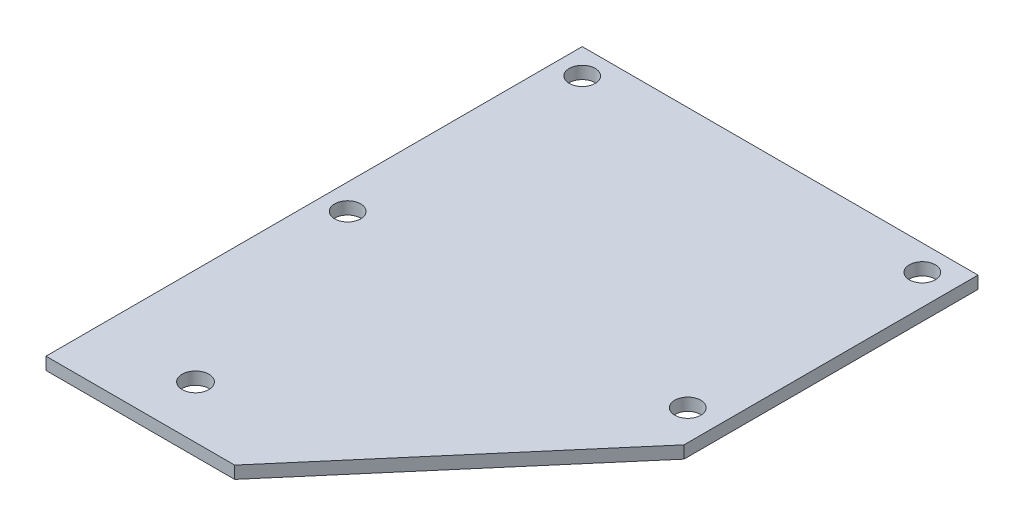
ISO-10303-21;
HEADER;
FILE_DESCRIPTION(('STEP AP214'),'2;1');
FILE_NAME('part.step','',(''),(''),'','','');
FILE_SCHEMA(('AUTOMOTIVE_DESIGN { 1 0 10303 214 1 1 1 1 }'));
ENDSEC;
DATA;
#1=APPLICATION_CONTEXT('core data for automotive mechanical design processes');
#2=APPLICATION_PROTOCOL_DEFINITION('international standard','automotive_design',2000,#1);
#3=PRODUCT_CONTEXT('',#1,'mechanical');
#4=PRODUCT('Part','Part','',(#3));
#5=PRODUCT_RELATED_PRODUCT_CATEGORY('part','',(#4));
#6=PRODUCT_DEFINITION_FORMATION('','',#4);
#7=PRODUCT_DEFINITION_CONTEXT('part definition',#1,'design');
#8=PRODUCT_DEFINITION('design','',#6,#7);
#9=PRODUCT_DEFINITION_SHAPE('','',#8);
#10=(LENGTH_UNIT() NAMED_UNIT(*) SI_UNIT(.MILLI.,.METRE.));
#11=(NAMED_UNIT(*) PLANE_ANGLE_UNIT() SI_UNIT($,.RADIAN.));
#12=(NAMED_UNIT(*) SI_UNIT($,.STERADIAN.) SOLID_ANGLE_UNIT());
#13=UNCERTAINTY_MEASURE_WITH_UNIT(LENGTH_MEASURE(1.E-05),#10,'distance_accuracy_value','');
#14=(GEOMETRIC_REPRESENTATION_CONTEXT(3) GLOBAL_UNCERTAINTY_ASSIGNED_CONTEXT((#13)) GLOBAL_UNIT_ASSIGNED_CONTEXT((#10,
#11,#12)) REPRESENTATION_CONTEXT('',''));
#15=CARTESIAN_POINT('',(0.,0.,0.));
#16=DIRECTION('',(0.,0.,1.));
#17=DIRECTION('',(1.,0.,0.));
#18=AXIS2_PLACEMENT_3D('',#15,#16,#17);
#19=CARTESIAN_POINT('',(0.,3.175,0.));
#20=DIRECTION('',(0.,-1.,0.));
#21=DIRECTION('',(0.,0.,-1.));
#22=AXIS2_PLACEMENT_3D('',#19,#20,#21);
#23=PLANE('',#22);
#24=DIRECTION('',(0.,0.,-1.));
#25=VECTOR('',#24,1.);
#26=CARTESIAN_POINT('',(101.24,3.175,-68.58));
#27=LINE('',#26,#25);
#28=CARTESIAN_POINT('',(101.24,3.175,6.62));
#29=VERTEX_POINT('',#28);
#30=CARTESIAN_POINT('',(101.24,3.175,-68.58));
#31=VERTEX_POINT('',#30);
#32=EDGE_CURVE('E116',#29,#31,#27,.T.);
#33=ORIENTED_EDGE('',*,*,#32,.T.);
#34=DIRECTION('',(-1.,0.,0.));
#35=VECTOR('',#34,1.);
#36=CARTESIAN_POINT('',(0.,3.175,-68.58));
#37=LINE('',#36,#35);
#38=CARTESIAN_POINT('',(0.,3.175,-68.58));
#39=VERTEX_POINT('',#38);
#40=EDGE_CURVE('E83',#31,#39,#37,.T.);
#41=ORIENTED_EDGE('',*,*,#40,.T.);
#42=DIRECTION('',(0.,0.,1.));
#43=VECTOR('',#42,1.);
#44=CARTESIAN_POINT('',(0.,3.175,68.58));
#45=LINE('',#44,#43);
#46=CARTESIAN_POINT('',(0.,3.175,68.58));
#47=VERTEX_POINT('',#46);
#48=EDGE_CURVE('E87',#39,#47,#45,.T.);
#49=ORIENTED_EDGE('',*,*,#48,.T.);
#50=DIRECTION('',(1.,0.,0.));
#51=VECTOR('',#50,1.);
#52=CARTESIAN_POINT('',(48.26,3.175,68.58));
#53=LINE('',#52,#51);
#54=CARTESIAN_POINT('',(48.26,3.175,68.58));
#55=VERTEX_POINT('',#54);
#56=EDGE_CURVE('E91',#47,#55,#53,.T.);
#57=ORIENTED_EDGE('',*,*,#56,.T.);
#58=DIRECTION('',(0.649881739167687,0.,-0.760035344636276));
#59=VECTOR('',#58,1.);
#60=CARTESIAN_POINT('',(101.24,3.175,6.62));
#61=LINE('',#60,#59);
#62=EDGE_CURVE('E49',#55,#29,#61,.T.);
#63=ORIENTED_EDGE('',*,*,#62,.T.);
#64=EDGE_LOOP('',(#33,#41,#49,#57,#63));
#65=FACE_BOUND('',#64,.T.);
#66=CARTESIAN_POINT('',(93.5,3.175,-62.08));
#67=DIRECTION('',(0.,1.,0.));
#68=DIRECTION('',(0.,0.,1.));
#69=AXIS2_PLACEMENT_3D('',#66,#67,#68);
#70=CIRCLE('',#69,3.32999999999999);
#71=CARTESIAN_POINT('',(93.5,3.175,-58.75));
#72=VERTEX_POINT('',#71);
#73=EDGE_CURVE('E111',#72,#72,#70,.T.);
#74=ORIENTED_EDGE('',*,*,#73,.F.);
#75=EDGE_LOOP('',(#74));
#76=FACE_BOUND('',#75,.T.);
#77=CARTESIAN_POINT('',(6.5,3.175,-62.08));
#78=DIRECTION('',(0.,1.,0.));
#79=DIRECTION('',(0.,0.,1.));
#80=AXIS2_PLACEMENT_3D('',#77,#78,#79);
#81=CIRCLE('',#80,3.33000000000001);
#82=CARTESIAN_POINT('',(6.5,3.175,-58.75));
#83=VERTEX_POINT('',#82);
#84=EDGE_CURVE('E185',#83,#83,#81,.T.);
#85=ORIENTED_EDGE('',*,*,#84,.F.);
#86=EDGE_LOOP('',(#85));
#87=FACE_BOUND('',#86,.T.);
#88=CARTESIAN_POINT('',(93.5,3.175,-2.08000000000001));
#89=DIRECTION('',(0.,1.,0.));
#90=DIRECTION('',(0.,0.,1.));
#91=AXIS2_PLACEMENT_3D('',#88,#89,#90);
#92=CIRCLE('',#91,3.32999999999999);
#93=CARTESIAN_POINT('',(93.5,3.175,1.24999999999999));
#94=VERTEX_POINT('',#93);
#95=EDGE_CURVE('E179',#94,#94,#92,.T.);
#96=ORIENTED_EDGE('',*,*,#95,.F.);
#97=EDGE_LOOP('',(#96));
#98=FACE_BOUND('',#97,.T.);
#99=CARTESIAN_POINT('',(6.50000000000001,3.175,-2.08));
#100=DIRECTION('',(0.,1.,0.));
#101=DIRECTION('',(0.,0.,1.));
#102=AXIS2_PLACEMENT_3D('',#99,#100,#101);
#103=CIRCLE('',#102,3.33);
#104=CARTESIAN_POINT('',(6.50000000000001,3.175,1.25));
#105=VERTEX_POINT('',#104);
#106=EDGE_CURVE('E173',#105,#105,#103,.T.);
#107=ORIENTED_EDGE('',*,*,#106,.F.);
#108=EDGE_LOOP('',(#107));
#109=FACE_BOUND('',#108,.T.);
#110=CARTESIAN_POINT('',(24.82,3.175,55.16));
#111=DIRECTION('',(0.,1.,0.));
#112=DIRECTION('',(0.,0.,1.));
#113=AXIS2_PLACEMENT_3D('',#110,#111,#112);
#114=CIRCLE('',#113,3.41999999999999);
#115=CARTESIAN_POINT('',(24.82,3.175,58.58));
#116=VERTEX_POINT('',#115);
#117=EDGE_CURVE('E164',#116,#116,#114,.T.);
#118=ORIENTED_EDGE('',*,*,#117,.F.);
#119=EDGE_LOOP('',(#118));
#120=FACE_BOUND('',#119,.T.);
#121=ADVANCED_FACE('F32',(#65,#76,#87,#98,#109,#120),#23,.F.);
#122=CARTESIAN_POINT('',(0.,0.,0.));
#123=DIRECTION('',(0.,-1.,0.));
#124=DIRECTION('',(0.,0.,-1.));
#125=AXIS2_PLACEMENT_3D('',#122,#123,#124);
#126=PLANE('',#125);
#127=CARTESIAN_POINT('',(6.50000000000001,0.,-2.08));
#128=DIRECTION('',(0.,1.,0.));
#129=DIRECTION('',(0.,0.,1.));
#130=AXIS2_PLACEMENT_3D('',#127,#128,#129);
#131=CIRCLE('',#130,3.33);
#132=CARTESIAN_POINT('',(6.50000000000001,0.,1.25));
#133=VERTEX_POINT('',#132);
#134=EDGE_CURVE('E170',#133,#133,#131,.T.);
#135=ORIENTED_EDGE('',*,*,#134,.T.);
#136=EDGE_LOOP('',(#135));
#137=FACE_BOUND('',#136,.T.);
#138=CARTESIAN_POINT('',(6.5,0.,-62.08));
#139=DIRECTION('',(0.,1.,0.));
#140=DIRECTION('',(0.,0.,1.));
#141=AXIS2_PLACEMENT_3D('',#138,#139,#140);
#142=CIRCLE('',#141,3.33000000000001);
#143=CARTESIAN_POINT('',(6.5,0.,-58.75));
#144=VERTEX_POINT('',#143);
#145=EDGE_CURVE('E182',#144,#144,#142,.T.);
#146=ORIENTED_EDGE('',*,*,#145,.T.);
#147=EDGE_LOOP('',(#146));
#148=FACE_BOUND('',#147,.T.);
#149=DIRECTION('',(0.,0.,-1.));
#150=VECTOR('',#149,1.);
#151=CARTESIAN_POINT('',(101.24,0.,-68.58));
#152=LINE('',#151,#150);
#153=CARTESIAN_POINT('',(101.24,0.,6.62));
#154=VERTEX_POINT('',#153);
#155=CARTESIAN_POINT('',(101.24,0.,-68.58));
#156=VERTEX_POINT('',#155);
#157=EDGE_CURVE('E107',#154,#156,#152,.T.);
#158=ORIENTED_EDGE('',*,*,#157,.F.);
#159=DIRECTION('',(0.649881739167687,0.,-0.760035344636276));
#160=VECTOR('',#159,1.);
#161=CARTESIAN_POINT('',(101.24,0.,6.62));
#162=LINE('',#161,#160);
#163=CARTESIAN_POINT('',(48.26,0.,68.58));
#164=VERTEX_POINT('',#163);
#165=EDGE_CURVE('E75',#164,#154,#162,.T.);
#166=ORIENTED_EDGE('',*,*,#165,.F.);
#167=DIRECTION('',(1.,0.,0.));
#168=VECTOR('',#167,1.);
#169=CARTESIAN_POINT('',(48.26,0.,68.58));
#170=LINE('',#169,#168);
#171=CARTESIAN_POINT('',(0.,0.,68.58));
#172=VERTEX_POINT('',#171);
#173=EDGE_CURVE('E69',#172,#164,#170,.T.);
#174=ORIENTED_EDGE('',*,*,#173,.F.);
#175=DIRECTION('',(0.,0.,1.));
#176=VECTOR('',#175,1.);
#177=CARTESIAN_POINT('',(0.,0.,68.58));
#178=LINE('',#177,#176);
#179=CARTESIAN_POINT('',(0.,0.,-68.58));
#180=VERTEX_POINT('',#179);
#181=EDGE_CURVE('E98',#180,#172,#178,.T.);
#182=ORIENTED_EDGE('',*,*,#181,.F.);
#183=DIRECTION('',(-1.,0.,0.));
#184=VECTOR('',#183,1.);
#185=CARTESIAN_POINT('',(0.,0.,-68.58));
#186=LINE('',#185,#184);
#187=EDGE_CURVE('E110',#156,#180,#186,.T.);
#188=ORIENTED_EDGE('',*,*,#187,.F.);
#189=EDGE_LOOP('',(#158,#166,#174,#182,#188));
#190=FACE_BOUND('',#189,.T.);
#191=CARTESIAN_POINT('',(93.5,0.,-62.08));
#192=DIRECTION('',(0.,1.,0.));
#193=DIRECTION('',(0.,0.,1.));
#194=AXIS2_PLACEMENT_3D('',#191,#192,#193);
#195=CIRCLE('',#194,3.32999999999999);
#196=CARTESIAN_POINT('',(93.5,0.,-58.75));
#197=VERTEX_POINT('',#196);
#198=EDGE_CURVE('E188',#197,#197,#195,.T.);
#199=ORIENTED_EDGE('',*,*,#198,.T.);
#200=EDGE_LOOP('',(#199));
#201=FACE_BOUND('',#200,.T.);
#202=CARTESIAN_POINT('',(93.5,0.,-2.08000000000001));
#203=DIRECTION('',(0.,1.,0.));
#204=DIRECTION('',(0.,0.,1.));
#205=AXIS2_PLACEMENT_3D('',#202,#203,#204);
#206=CIRCLE('',#205,3.32999999999999);
#207=CARTESIAN_POINT('',(93.5,0.,1.24999999999999));
#208=VERTEX_POINT('',#207);
#209=EDGE_CURVE('E176',#208,#208,#206,.T.);
#210=ORIENTED_EDGE('',*,*,#209,.T.);
#211=EDGE_LOOP('',(#210));
#212=FACE_BOUND('',#211,.T.);
#213=CARTESIAN_POINT('',(24.82,0.,55.16));
#214=DIRECTION('',(0.,1.,0.));
#215=DIRECTION('',(0.,0.,1.));
#216=AXIS2_PLACEMENT_3D('',#213,#214,#215);
#217=CIRCLE('',#216,3.41999999999999);
#218=CARTESIAN_POINT('',(24.82,0.,58.58));
#219=VERTEX_POINT('',#218);
#220=EDGE_CURVE('E167',#219,#219,#217,.T.);
#221=ORIENTED_EDGE('',*,*,#220,.T.);
#222=EDGE_LOOP('',(#221));
#223=FACE_BOUND('',#222,.T.);
#224=ADVANCED_FACE('F120',(#137,#148,#190,#201,#212,#223),#126,.T.);
#225=CARTESIAN_POINT('',(101.24,3.175,-68.58));
#226=DIRECTION('',(-1.,0.,0.));
#227=DIRECTION('',(0.,0.,1.));
#228=AXIS2_PLACEMENT_3D('',#225,#226,#227);
#229=PLANE('',#228);
#230=ORIENTED_EDGE('',*,*,#157,.T.);
#231=DIRECTION('',(0.,-1.,0.));
#232=VECTOR('',#231,1.);
#233=CARTESIAN_POINT('',(101.24,3.175,-68.58));
#234=LINE('',#233,#232);
#235=EDGE_CURVE('E11',#31,#156,#234,.T.);
#236=ORIENTED_EDGE('',*,*,#235,.F.);
#237=ORIENTED_EDGE('',*,*,#32,.F.);
#238=DIRECTION('',(0.,-1.,0.));
#239=VECTOR('',#238,1.);
#240=CARTESIAN_POINT('',(101.24,3.175,6.62));
#241=LINE('',#240,#239);
#242=EDGE_CURVE('E103',#29,#154,#241,.T.);
#243=ORIENTED_EDGE('',*,*,#242,.T.);
#244=EDGE_LOOP('',(#230,#236,#237,#243));
#245=FACE_BOUND('',#244,.T.);
#246=ADVANCED_FACE('F34',(#245),#229,.F.);
#247=CARTESIAN_POINT('',(0.,3.175,-68.58));
#248=DIRECTION('',(0.,0.,1.));
#249=DIRECTION('',(1.,0.,0.));
#250=AXIS2_PLACEMENT_3D('',#247,#248,#249);
#251=PLANE('',#250);
#252=ORIENTED_EDGE('',*,*,#187,.T.);
#253=DIRECTION('',(0.,-1.,0.));
#254=VECTOR('',#253,1.);
#255=CARTESIAN_POINT('',(0.,3.175,-68.58));
#256=LINE('',#255,#254);
#257=EDGE_CURVE('E41',#39,#180,#256,.T.);
#258=ORIENTED_EDGE('',*,*,#257,.F.);
#259=ORIENTED_EDGE('',*,*,#40,.F.);
#260=ORIENTED_EDGE('',*,*,#235,.T.);
#261=EDGE_LOOP('',(#252,#258,#259,#260));
#262=FACE_BOUND('',#261,.T.);
#263=ADVANCED_FACE('F248',(#262),#251,.F.);
#264=CARTESIAN_POINT('',(0.,3.175,68.58));
#265=DIRECTION('',(1.,0.,0.));
#266=DIRECTION('',(0.,0.,-1.));
#267=AXIS2_PLACEMENT_3D('',#264,#265,#266);
#268=PLANE('',#267);
#269=ORIENTED_EDGE('',*,*,#181,.T.);
#270=DIRECTION('',(0.,-1.,0.));
#271=VECTOR('',#270,1.);
#272=CARTESIAN_POINT('',(0.,3.175,68.58));
#273=LINE('',#272,#271);
#274=EDGE_CURVE('E95',#47,#172,#273,.T.);
#275=ORIENTED_EDGE('',*,*,#274,.F.);
#276=ORIENTED_EDGE('',*,*,#48,.F.);
#277=ORIENTED_EDGE('',*,*,#257,.T.);
#278=EDGE_LOOP('',(#269,#275,#276,#277));
#279=FACE_BOUND('',#278,.T.);
#280=ADVANCED_FACE('F96',(#279),#268,.F.);
#281=CARTESIAN_POINT('',(48.26,3.175,68.58));
#282=DIRECTION('',(0.,0.,-1.));
#283=DIRECTION('',(-1.,0.,0.));
#284=AXIS2_PLACEMENT_3D('',#281,#282,#283);
#285=PLANE('',#284);
#286=ORIENTED_EDGE('',*,*,#173,.T.);
#287=DIRECTION('',(0.,-1.,0.));
#288=VECTOR('',#287,1.);
#289=CARTESIAN_POINT('',(48.26,3.175,68.58));
#290=LINE('',#289,#288);
#291=EDGE_CURVE('E99',#55,#164,#290,.T.);
#292=ORIENTED_EDGE('',*,*,#291,.F.);
#293=ORIENTED_EDGE('',*,*,#56,.F.);
#294=ORIENTED_EDGE('',*,*,#274,.T.);
#295=EDGE_LOOP('',(#286,#292,#293,#294));
#296=FACE_BOUND('',#295,.T.);
#297=ADVANCED_FACE('F101',(#296),#285,.F.);
#298=CARTESIAN_POINT('',(101.24,3.175,6.62));
#299=DIRECTION('',(-0.760035344636276,0.,-0.649881739167687));
#300=DIRECTION('',(-0.649881739167687,0.,0.760035344636276));
#301=AXIS2_PLACEMENT_3D('',#298,#299,#300);
#302=PLANE('',#301);
#303=ORIENTED_EDGE('',*,*,#165,.T.);
#304=ORIENTED_EDGE('',*,*,#242,.F.);
#305=ORIENTED_EDGE('',*,*,#62,.F.);
#306=ORIENTED_EDGE('',*,*,#291,.T.);
#307=EDGE_LOOP('',(#303,#304,#305,#306));
#308=FACE_BOUND('',#307,.T.);
#309=ADVANCED_FACE('F125',(#308),#302,.F.);
#310=CARTESIAN_POINT('',(93.5,3.175,-62.08));
#311=DIRECTION('',(0.,-1.,0.));
#312=DIRECTION('',(0.,0.,-1.));
#313=AXIS2_PLACEMENT_3D('',#310,#311,#312);
#314=CYLINDRICAL_SURFACE('',#313,3.32999999999999);
#315=ORIENTED_EDGE('',*,*,#73,.T.);
#316=EDGE_LOOP('',(#315));
#317=FACE_BOUND('',#316,.T.);
#318=ORIENTED_EDGE('',*,*,#198,.F.);
#319=EDGE_LOOP('',(#318));
#320=FACE_BOUND('',#319,.T.);
#321=ADVANCED_FACE('F127',(#317,#320),#314,.F.);
#322=CARTESIAN_POINT('',(6.5,3.175,-62.08));
#323=DIRECTION('',(0.,-1.,0.));
#324=DIRECTION('',(0.,0.,-1.));
#325=AXIS2_PLACEMENT_3D('',#322,#323,#324);
#326=CYLINDRICAL_SURFACE('',#325,3.33000000000001);
#327=ORIENTED_EDGE('',*,*,#84,.T.);
#328=EDGE_LOOP('',(#327));
#329=FACE_BOUND('',#328,.T.);
#330=ORIENTED_EDGE('',*,*,#145,.F.);
#331=EDGE_LOOP('',(#330));
#332=FACE_BOUND('',#331,.T.);
#333=ADVANCED_FACE('F133',(#329,#332),#326,.F.);
#334=CARTESIAN_POINT('',(93.5,3.175,-2.08000000000001));
#335=DIRECTION('',(0.,-1.,0.));
#336=DIRECTION('',(0.,0.,-1.));
#337=AXIS2_PLACEMENT_3D('',#334,#335,#336);
#338=CYLINDRICAL_SURFACE('',#337,3.32999999999999);
#339=ORIENTED_EDGE('',*,*,#95,.T.);
#340=EDGE_LOOP('',(#339));
#341=FACE_BOUND('',#340,.T.);
#342=ORIENTED_EDGE('',*,*,#209,.F.);
#343=EDGE_LOOP('',(#342));
#344=FACE_BOUND('',#343,.T.);
#345=ADVANCED_FACE('F147',(#341,#344),#338,.F.);
#346=CARTESIAN_POINT('',(6.50000000000001,3.175,-2.08));
#347=DIRECTION('',(0.,-1.,0.));
#348=DIRECTION('',(0.,0.,-1.));
#349=AXIS2_PLACEMENT_3D('',#346,#347,#348);
#350=CYLINDRICAL_SURFACE('',#349,3.33);
#351=ORIENTED_EDGE('',*,*,#106,.T.);
#352=EDGE_LOOP('',(#351));
#353=FACE_BOUND('',#352,.T.);
#354=ORIENTED_EDGE('',*,*,#134,.F.);
#355=EDGE_LOOP('',(#354));
#356=FACE_BOUND('',#355,.T.);
#357=ADVANCED_FACE('F151',(#353,#356),#350,.F.);
#358=CARTESIAN_POINT('',(24.82,3.175,55.16));
#359=DIRECTION('',(0.,-1.,0.));
#360=DIRECTION('',(0.,0.,-1.));
#361=AXIS2_PLACEMENT_3D('',#358,#359,#360);
#362=CYLINDRICAL_SURFACE('',#361,3.41999999999999);
#363=ORIENTED_EDGE('',*,*,#117,.T.);
#364=EDGE_LOOP('',(#363));
#365=FACE_BOUND('',#364,.T.);
#366=ORIENTED_EDGE('',*,*,#220,.F.);
#367=EDGE_LOOP('',(#366));
#368=FACE_BOUND('',#367,.T.);
#369=ADVANCED_FACE('F155',(#365,#368),#362,.F.);
#370=CLOSED_SHELL('',(#121,#224,#246,#263,#280,#297,#309,#321,#333,#345,#357,#369));
#371=MANIFOLD_SOLID_BREP('B2',#370);
#372=ADVANCED_BREP_SHAPE_REPRESENTATION('',(#18,#371),#14);
#373=SHAPE_DEFINITION_REPRESENTATION(#9,#372);
ENDSEC;
END-ISO-10303-21;
